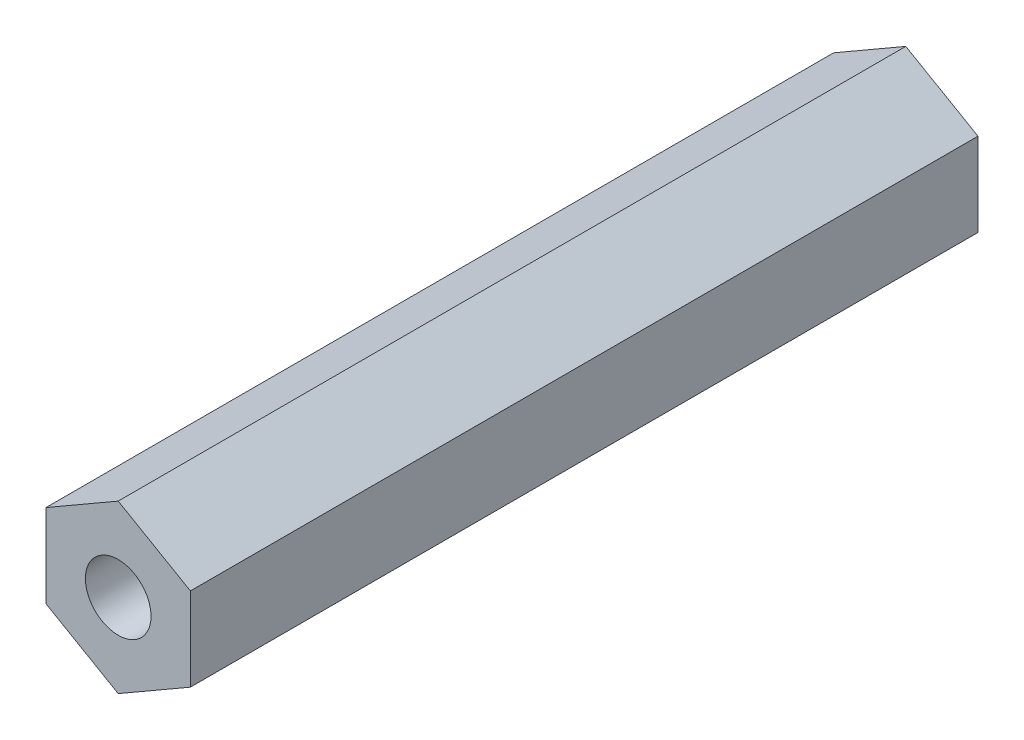
ISO-10303-21;
HEADER;
FILE_DESCRIPTION(('STEP AP214'),'2;1');
FILE_NAME('part.step','',(''),(''),'','','');
FILE_SCHEMA(('AUTOMOTIVE_DESIGN { 1 0 10303 214 1 1 1 1 }'));
ENDSEC;
DATA;
#1=APPLICATION_CONTEXT('core data for automotive mechanical design processes');
#2=APPLICATION_PROTOCOL_DEFINITION('international standard','automotive_design',2000,#1);
#3=PRODUCT_CONTEXT('',#1,'mechanical');
#4=PRODUCT('Part','Part','',(#3));
#5=PRODUCT_RELATED_PRODUCT_CATEGORY('part','',(#4));
#6=PRODUCT_DEFINITION_FORMATION('','',#4);
#7=PRODUCT_DEFINITION_CONTEXT('part definition',#1,'design');
#8=PRODUCT_DEFINITION('design','',#6,#7);
#9=PRODUCT_DEFINITION_SHAPE('','',#8);
#10=(LENGTH_UNIT() NAMED_UNIT(*) SI_UNIT(.MILLI.,.METRE.));
#11=(NAMED_UNIT(*) PLANE_ANGLE_UNIT() SI_UNIT($,.RADIAN.));
#12=(NAMED_UNIT(*) SI_UNIT($,.STERADIAN.) SOLID_ANGLE_UNIT());
#13=UNCERTAINTY_MEASURE_WITH_UNIT(LENGTH_MEASURE(1.E-05),#10,'distance_accuracy_value','');
#14=(GEOMETRIC_REPRESENTATION_CONTEXT(3) GLOBAL_UNCERTAINTY_ASSIGNED_CONTEXT((#13)) GLOBAL_UNIT_ASSIGNED_CONTEXT((#10,
#11,#12)) REPRESENTATION_CONTEXT('',''));
#15=CARTESIAN_POINT('',(0.,0.,0.));
#16=DIRECTION('',(0.,0.,1.));
#17=DIRECTION('',(1.,0.,0.));
#18=AXIS2_PLACEMENT_3D('',#15,#16,#17);
#19=CARTESIAN_POINT('',(-2.75,-1.58771324027147,30.));
#20=DIRECTION('',(0.5,0.866025403784438,0.));
#21=DIRECTION('',(-0.866025403784439,0.5,0.));
#22=AXIS2_PLACEMENT_3D('',#19,#20,#21);
#23=PLANE('',#22);
#24=DIRECTION('',(0.866025403784438,-0.5,0.));
#25=VECTOR('',#24,1.);
#26=CARTESIAN_POINT('',(-2.75,-1.58771324027147,0.));
#27=LINE('',#26,#25);
#28=CARTESIAN_POINT('',(-2.75,-1.58771324027147,0.));
#29=VERTEX_POINT('',#28);
#30=CARTESIAN_POINT('',(0.,-3.17542648054294,0.));
#31=VERTEX_POINT('',#30);
#32=EDGE_CURVE('E117',#29,#31,#27,.T.);
#33=ORIENTED_EDGE('',*,*,#32,.T.);
#34=DIRECTION('',(0.,0.,-1.));
#35=VECTOR('',#34,1.);
#36=CARTESIAN_POINT('',(0.,-3.17542648054294,30.));
#37=LINE('',#36,#35);
#38=CARTESIAN_POINT('',(0.,-3.17542648054294,30.));
#39=VERTEX_POINT('',#38);
#40=EDGE_CURVE('E11',#39,#31,#37,.T.);
#41=ORIENTED_EDGE('',*,*,#40,.F.);
#42=DIRECTION('',(0.866025403784438,-0.5,0.));
#43=VECTOR('',#42,1.);
#44=CARTESIAN_POINT('',(-2.75,-1.58771324027147,30.));
#45=LINE('',#44,#43);
#46=CARTESIAN_POINT('',(-2.75,-1.58771324027147,30.));
#47=VERTEX_POINT('',#46);
#48=EDGE_CURVE('E128',#47,#39,#45,.T.);
#49=ORIENTED_EDGE('',*,*,#48,.F.);
#50=DIRECTION('',(0.,0.,-1.));
#51=VECTOR('',#50,1.);
#52=CARTESIAN_POINT('',(-2.75,-1.58771324027147,30.));
#53=LINE('',#52,#51);
#54=EDGE_CURVE('E113',#47,#29,#53,.T.);
#55=ORIENTED_EDGE('',*,*,#54,.T.);
#56=EDGE_LOOP('',(#33,#41,#49,#55));
#57=FACE_BOUND('',#56,.T.);
#58=ADVANCED_FACE('F30',(#57),#23,.F.);
#59=CARTESIAN_POINT('',(0.,-3.17542648054294,30.));
#60=DIRECTION('',(-0.5,0.866025403784438,0.));
#61=DIRECTION('',(-0.866025403784439,-0.5,0.));
#62=AXIS2_PLACEMENT_3D('',#59,#60,#61);
#63=PLANE('',#62);
#64=DIRECTION('',(0.866025403784438,0.5,0.));
#65=VECTOR('',#64,1.);
#66=CARTESIAN_POINT('',(0.,-3.17542648054294,0.));
#67=LINE('',#66,#65);
#68=CARTESIAN_POINT('',(2.75,-1.58771324027147,0.));
#69=VERTEX_POINT('',#68);
#70=EDGE_CURVE('E120',#31,#69,#67,.T.);
#71=ORIENTED_EDGE('',*,*,#70,.T.);
#72=DIRECTION('',(0.,0.,-1.));
#73=VECTOR('',#72,1.);
#74=CARTESIAN_POINT('',(2.75,-1.58771324027147,30.));
#75=LINE('',#74,#73);
#76=CARTESIAN_POINT('',(2.75,-1.58771324027147,30.));
#77=VERTEX_POINT('',#76);
#78=EDGE_CURVE('E38',#77,#69,#75,.T.);
#79=ORIENTED_EDGE('',*,*,#78,.F.);
#80=DIRECTION('',(0.866025403784438,0.5,0.));
#81=VECTOR('',#80,1.);
#82=CARTESIAN_POINT('',(0.,-3.17542648054294,30.));
#83=LINE('',#82,#81);
#84=EDGE_CURVE('E84',#39,#77,#83,.T.);
#85=ORIENTED_EDGE('',*,*,#84,.F.);
#86=ORIENTED_EDGE('',*,*,#40,.T.);
#87=EDGE_LOOP('',(#71,#79,#85,#86));
#88=FACE_BOUND('',#87,.T.);
#89=ADVANCED_FACE('F153',(#88),#63,.F.);
#90=CARTESIAN_POINT('',(2.75,-1.58771324027147,30.));
#91=DIRECTION('',(-1.,0.,0.));
#92=DIRECTION('',(0.,0.,1.));
#93=AXIS2_PLACEMENT_3D('',#90,#91,#92);
#94=PLANE('',#93);
#95=DIRECTION('',(0.,1.,0.));
#96=VECTOR('',#95,1.);
#97=CARTESIAN_POINT('',(2.75,-1.58771324027147,0.));
#98=LINE('',#97,#96);
#99=CARTESIAN_POINT('',(2.75,1.58771324027147,0.));
#100=VERTEX_POINT('',#99);
#101=EDGE_CURVE('E123',#69,#100,#98,.T.);
#102=ORIENTED_EDGE('',*,*,#101,.T.);
#103=DIRECTION('',(0.,0.,-1.));
#104=VECTOR('',#103,1.);
#105=CARTESIAN_POINT('',(2.75,1.58771324027147,30.));
#106=LINE('',#105,#104);
#107=CARTESIAN_POINT('',(2.75,1.58771324027147,30.));
#108=VERTEX_POINT('',#107);
#109=EDGE_CURVE('E108',#108,#100,#106,.T.);
#110=ORIENTED_EDGE('',*,*,#109,.F.);
#111=DIRECTION('',(0.,1.,0.));
#112=VECTOR('',#111,1.);
#113=CARTESIAN_POINT('',(2.75,-1.58771324027147,30.));
#114=LINE('',#113,#112);
#115=EDGE_CURVE('E99',#77,#108,#114,.T.);
#116=ORIENTED_EDGE('',*,*,#115,.F.);
#117=ORIENTED_EDGE('',*,*,#78,.T.);
#118=EDGE_LOOP('',(#102,#110,#116,#117));
#119=FACE_BOUND('',#118,.T.);
#120=ADVANCED_FACE('F134',(#119),#94,.F.);
#121=CARTESIAN_POINT('',(2.75,1.58771324027147,30.));
#122=DIRECTION('',(-0.5,-0.866025403784439,0.));
#123=DIRECTION('',(0.866025403784439,-0.5,0.));
#124=AXIS2_PLACEMENT_3D('',#121,#122,#123);
#125=PLANE('',#124);
#126=DIRECTION('',(-0.866025403784439,0.5,0.));
#127=VECTOR('',#126,1.);
#128=CARTESIAN_POINT('',(2.75,1.58771324027147,0.));
#129=LINE('',#128,#127);
#130=CARTESIAN_POINT('',(0.,3.17542648054294,0.));
#131=VERTEX_POINT('',#130);
#132=EDGE_CURVE('E107',#100,#131,#129,.T.);
#133=ORIENTED_EDGE('',*,*,#132,.T.);
#134=DIRECTION('',(0.,0.,-1.));
#135=VECTOR('',#134,1.);
#136=CARTESIAN_POINT('',(0.,3.17542648054294,30.));
#137=LINE('',#136,#135);
#138=CARTESIAN_POINT('',(0.,3.17542648054294,30.));
#139=VERTEX_POINT('',#138);
#140=EDGE_CURVE('E104',#139,#131,#137,.T.);
#141=ORIENTED_EDGE('',*,*,#140,.F.);
#142=DIRECTION('',(-0.866025403784439,0.5,0.));
#143=VECTOR('',#142,1.);
#144=CARTESIAN_POINT('',(2.75,1.58771324027147,30.));
#145=LINE('',#144,#143);
#146=EDGE_CURVE('E93',#108,#139,#145,.T.);
#147=ORIENTED_EDGE('',*,*,#146,.F.);
#148=ORIENTED_EDGE('',*,*,#109,.T.);
#149=EDGE_LOOP('',(#133,#141,#147,#148));
#150=FACE_BOUND('',#149,.T.);
#151=ADVANCED_FACE('F105',(#150),#125,.F.);
#152=CARTESIAN_POINT('',(0.,3.17542648054294,30.));
#153=DIRECTION('',(0.5,-0.866025403784439,0.));
#154=DIRECTION('',(0.866025403784439,0.5,0.));
#155=AXIS2_PLACEMENT_3D('',#152,#153,#154);
#156=PLANE('',#155);
#157=DIRECTION('',(-0.866025403784439,-0.5,0.));
#158=VECTOR('',#157,1.);
#159=CARTESIAN_POINT('',(0.,3.17542648054294,0.));
#160=LINE('',#159,#158);
#161=CARTESIAN_POINT('',(-2.75,1.58771324027147,0.));
#162=VERTEX_POINT('',#161);
#163=EDGE_CURVE('E70',#131,#162,#160,.T.);
#164=ORIENTED_EDGE('',*,*,#163,.T.);
#165=DIRECTION('',(0.,0.,-1.));
#166=VECTOR('',#165,1.);
#167=CARTESIAN_POINT('',(-2.75,1.58771324027147,30.));
#168=LINE('',#167,#166);
#169=CARTESIAN_POINT('',(-2.75,1.58771324027147,30.));
#170=VERTEX_POINT('',#169);
#171=EDGE_CURVE('E109',#170,#162,#168,.T.);
#172=ORIENTED_EDGE('',*,*,#171,.F.);
#173=DIRECTION('',(-0.866025403784439,-0.5,0.));
#174=VECTOR('',#173,1.);
#175=CARTESIAN_POINT('',(0.,3.17542648054294,30.));
#176=LINE('',#175,#174);
#177=EDGE_CURVE('E97',#139,#170,#176,.T.);
#178=ORIENTED_EDGE('',*,*,#177,.F.);
#179=ORIENTED_EDGE('',*,*,#140,.T.);
#180=EDGE_LOOP('',(#164,#172,#178,#179));
#181=FACE_BOUND('',#180,.T.);
#182=ADVANCED_FACE('F111',(#181),#156,.F.);
#183=CARTESIAN_POINT('',(-2.75,1.58771324027147,30.));
#184=DIRECTION('',(1.,0.,0.));
#185=DIRECTION('',(0.,0.,-1.));
#186=AXIS2_PLACEMENT_3D('',#183,#184,#185);
#187=PLANE('',#186);
#188=DIRECTION('',(0.,-1.,0.));
#189=VECTOR('',#188,1.);
#190=CARTESIAN_POINT('',(-2.75,1.58771324027147,0.));
#191=LINE('',#190,#189);
#192=EDGE_CURVE('E76',#162,#29,#191,.T.);
#193=ORIENTED_EDGE('',*,*,#192,.T.);
#194=ORIENTED_EDGE('',*,*,#54,.F.);
#195=DIRECTION('',(0.,-1.,0.));
#196=VECTOR('',#195,1.);
#197=CARTESIAN_POINT('',(-2.75,1.58771324027147,30.));
#198=LINE('',#197,#196);
#199=EDGE_CURVE('E46',#170,#47,#198,.T.);
#200=ORIENTED_EDGE('',*,*,#199,.F.);
#201=ORIENTED_EDGE('',*,*,#171,.T.);
#202=EDGE_LOOP('',(#193,#194,#200,#201));
#203=FACE_BOUND('',#202,.T.);
#204=ADVANCED_FACE('F141',(#203),#187,.F.);
#205=CARTESIAN_POINT('',(0.,-3.17542648054294,30.));
#206=DIRECTION('',(0.,0.,1.));
#207=DIRECTION('',(1.,0.,0.));
#208=AXIS2_PLACEMENT_3D('',#205,#206,#207);
#209=PLANE('',#208);
#210=CARTESIAN_POINT('',(0.,0.,30.));
#211=DIRECTION('',(0.,0.,1.));
#212=DIRECTION('',(1.,0.,0.));
#213=AXIS2_PLACEMENT_3D('',#210,#211,#212);
#214=CIRCLE('',#213,1.25);
#215=CARTESIAN_POINT('',(1.25,0.,30.));
#216=VERTEX_POINT('',#215);
#217=EDGE_CURVE('E241',#216,#216,#214,.T.);
#218=ORIENTED_EDGE('',*,*,#217,.F.);
#219=EDGE_LOOP('',(#218));
#220=FACE_BOUND('',#219,.T.);
#221=ORIENTED_EDGE('',*,*,#48,.T.);
#222=ORIENTED_EDGE('',*,*,#84,.T.);
#223=ORIENTED_EDGE('',*,*,#115,.T.);
#224=ORIENTED_EDGE('',*,*,#146,.T.);
#225=ORIENTED_EDGE('',*,*,#177,.T.);
#226=ORIENTED_EDGE('',*,*,#199,.T.);
#227=EDGE_LOOP('',(#221,#222,#223,#224,#225,#226));
#228=FACE_BOUND('',#227,.T.);
#229=ADVANCED_FACE('F95',(#220,#228),#209,.T.);
#230=CARTESIAN_POINT('',(0.,-3.17542648054294,0.));
#231=DIRECTION('',(0.,0.,1.));
#232=DIRECTION('',(1.,0.,0.));
#233=AXIS2_PLACEMENT_3D('',#230,#231,#232);
#234=PLANE('',#233);
#235=CARTESIAN_POINT('',(0.,0.,0.));
#236=DIRECTION('',(0.,0.,-1.));
#237=DIRECTION('',(-1.,0.,0.));
#238=AXIS2_PLACEMENT_3D('',#235,#236,#237);
#239=CIRCLE('',#238,1.24999999999999);
#240=CARTESIAN_POINT('',(-1.24999999999999,0.,0.));
#241=VERTEX_POINT('',#240);
#242=EDGE_CURVE('E239',#241,#241,#239,.T.);
#243=ORIENTED_EDGE('',*,*,#242,.F.);
#244=EDGE_LOOP('',(#243));
#245=FACE_BOUND('',#244,.T.);
#246=ORIENTED_EDGE('',*,*,#32,.F.);
#247=ORIENTED_EDGE('',*,*,#192,.F.);
#248=ORIENTED_EDGE('',*,*,#163,.F.);
#249=ORIENTED_EDGE('',*,*,#132,.F.);
#250=ORIENTED_EDGE('',*,*,#101,.F.);
#251=ORIENTED_EDGE('',*,*,#70,.F.);
#252=EDGE_LOOP('',(#246,#247,#248,#249,#250,#251));
#253=FACE_BOUND('',#252,.T.);
#254=ADVANCED_FACE('F137',(#245,#253),#234,.F.);
#255=CARTESIAN_POINT('',(0.,0.,23.));
#256=DIRECTION('',(0.,0.,1.));
#257=DIRECTION('',(1.,0.,0.));
#258=AXIS2_PLACEMENT_3D('',#255,#256,#257);
#259=CONICAL_SURFACE('',#258,1.25,1.02974425867665);
#260=CARTESIAN_POINT('',(0.,0.,22.2489242262155));
#261=VERTEX_POINT('',#260);
#262=VERTEX_LOOP('',#261);
#263=FACE_BOUND('',#262,.T.);
#264=CARTESIAN_POINT('',(0.,0.,23.));
#265=DIRECTION('',(0.,0.,1.));
#266=DIRECTION('',(1.,0.,0.));
#267=AXIS2_PLACEMENT_3D('',#264,#265,#266);
#268=CIRCLE('',#267,1.25);
#269=CARTESIAN_POINT('',(1.25,0.,23.));
#270=VERTEX_POINT('',#269);
#271=EDGE_CURVE('E121',#270,#270,#268,.T.);
#272=ORIENTED_EDGE('',*,*,#271,.T.);
#273=EDGE_LOOP('',(#272));
#274=FACE_BOUND('',#273,.T.);
#275=ADVANCED_FACE('F188',(#263,#274),#259,.F.);
#276=CARTESIAN_POINT('',(0.,0.,30.));
#277=DIRECTION('',(0.,0.,1.));
#278=DIRECTION('',(1.,0.,0.));
#279=AXIS2_PLACEMENT_3D('',#276,#277,#278);
#280=CYLINDRICAL_SURFACE('',#279,1.25);
#281=ORIENTED_EDGE('',*,*,#271,.F.);
#282=EDGE_LOOP('',(#281));
#283=FACE_BOUND('',#282,.T.);
#284=ORIENTED_EDGE('',*,*,#217,.T.);
#285=EDGE_LOOP('',(#284));
#286=FACE_BOUND('',#285,.T.);
#287=ADVANCED_FACE('F193',(#283,#286),#280,.F.);
#288=CARTESIAN_POINT('',(0.,0.,6.99999999999999));
#289=DIRECTION('',(0.,0.,-1.));
#290=DIRECTION('',(-1.,0.,0.));
#291=AXIS2_PLACEMENT_3D('',#288,#289,#290);
#292=CONICAL_SURFACE('',#291,1.24999999999999,1.02974425867665);
#293=CARTESIAN_POINT('',(0.,0.,7.75107577378444));
#294=VERTEX_POINT('',#293);
#295=VERTEX_LOOP('',#294);
#296=FACE_BOUND('',#295,.T.);
#297=CARTESIAN_POINT('',(0.,0.,6.99999999999999));
#298=DIRECTION('',(0.,0.,-1.));
#299=DIRECTION('',(-1.,0.,0.));
#300=AXIS2_PLACEMENT_3D('',#297,#298,#299);
#301=CIRCLE('',#300,1.24999999999999);
#302=CARTESIAN_POINT('',(-1.24999999999999,0.,6.99999999999999));
#303=VERTEX_POINT('',#302);
#304=EDGE_CURVE('E236',#303,#303,#301,.T.);
#305=ORIENTED_EDGE('',*,*,#304,.T.);
#306=EDGE_LOOP('',(#305));
#307=FACE_BOUND('',#306,.T.);
#308=ADVANCED_FACE('F203',(#296,#307),#292,.F.);
#309=CARTESIAN_POINT('',(0.,0.,0.));
#310=DIRECTION('',(0.,0.,-1.));
#311=DIRECTION('',(-1.,0.,0.));
#312=AXIS2_PLACEMENT_3D('',#309,#310,#311);
#313=CYLINDRICAL_SURFACE('',#312,1.24999999999999);
#314=ORIENTED_EDGE('',*,*,#304,.F.);
#315=EDGE_LOOP('',(#314));
#316=FACE_BOUND('',#315,.T.);
#317=ORIENTED_EDGE('',*,*,#242,.T.);
#318=EDGE_LOOP('',(#317));
#319=FACE_BOUND('',#318,.T.);
#320=ADVANCED_FACE('F219',(#316,#319),#313,.F.);
#321=CLOSED_SHELL('',(#58,#89,#120,#151,#182,#204,#229,#254,#275,#287,#308,#320));
#322=MANIFOLD_SOLID_BREP('B2',#321);
#323=ADVANCED_BREP_SHAPE_REPRESENTATION('',(#18,#322),#14);
#324=SHAPE_DEFINITION_REPRESENTATION(#9,#323);
ENDSEC;
END-ISO-10303-21;
